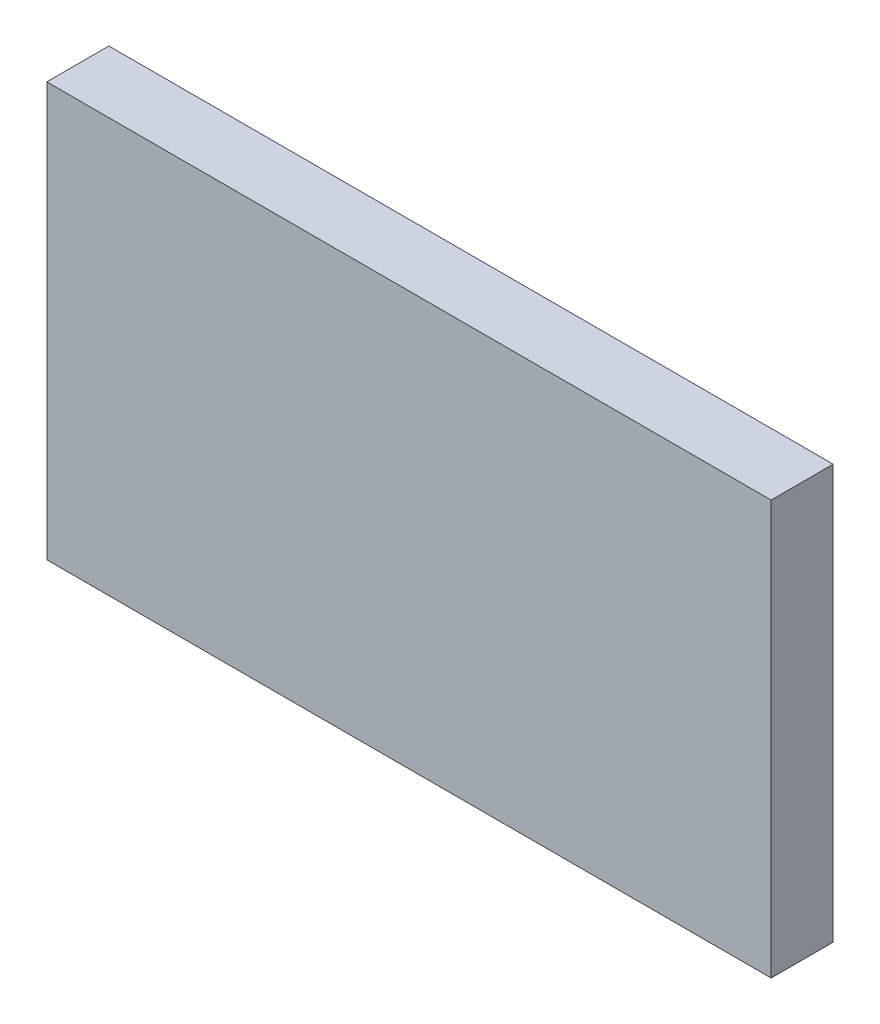
ISO-10303-21;
HEADER;
FILE_DESCRIPTION(('STEP AP214'),'2;1');
FILE_NAME('part.step','',(''),(''),'','','');
FILE_SCHEMA(('AUTOMOTIVE_DESIGN { 1 0 10303 214 1 1 1 1 }'));
ENDSEC;
DATA;
#1=APPLICATION_CONTEXT('core data for automotive mechanical design processes');
#2=APPLICATION_PROTOCOL_DEFINITION('international standard','automotive_design',2000,#1);
#3=PRODUCT_CONTEXT('',#1,'mechanical');
#4=PRODUCT('Part','Part','',(#3));
#5=PRODUCT_RELATED_PRODUCT_CATEGORY('part','',(#4));
#6=PRODUCT_DEFINITION_FORMATION('','',#4);
#7=PRODUCT_DEFINITION_CONTEXT('part definition',#1,'design');
#8=PRODUCT_DEFINITION('design','',#6,#7);
#9=PRODUCT_DEFINITION_SHAPE('','',#8);
#10=(LENGTH_UNIT() NAMED_UNIT(*) SI_UNIT(.MILLI.,.METRE.));
#11=(NAMED_UNIT(*) PLANE_ANGLE_UNIT() SI_UNIT($,.RADIAN.));
#12=(NAMED_UNIT(*) SI_UNIT($,.STERADIAN.) SOLID_ANGLE_UNIT());
#13=UNCERTAINTY_MEASURE_WITH_UNIT(LENGTH_MEASURE(1.E-05),#10,'distance_accuracy_value','');
#14=(GEOMETRIC_REPRESENTATION_CONTEXT(3) GLOBAL_UNCERTAINTY_ASSIGNED_CONTEXT((#13)) GLOBAL_UNIT_ASSIGNED_CONTEXT((#10,
#11,#12)) REPRESENTATION_CONTEXT('',''));
#15=CARTESIAN_POINT('',(0.,0.,0.));
#16=DIRECTION('',(0.,0.,1.));
#17=DIRECTION('',(1.,0.,0.));
#18=AXIS2_PLACEMENT_3D('',#15,#16,#17);
#19=CARTESIAN_POINT('',(-17.9136054421769,11.14,3.));
#20=DIRECTION('',(1.,0.,0.));
#21=DIRECTION('',(0.,0.,-1.));
#22=AXIS2_PLACEMENT_3D('',#19,#20,#21);
#23=PLANE('',#22);
#24=DIRECTION('',(0.,-1.,0.));
#25=VECTOR('',#24,1.);
#26=CARTESIAN_POINT('',(-17.9136054421769,11.14,0.));
#27=LINE('',#26,#25);
#28=CARTESIAN_POINT('',(-17.9136054421769,11.14,0.));
#29=VERTEX_POINT('',#28);
#30=CARTESIAN_POINT('',(-17.9136054421769,-8.86,0.));
#31=VERTEX_POINT('',#30);
#32=EDGE_CURVE('E95',#29,#31,#27,.T.);
#33=ORIENTED_EDGE('',*,*,#32,.T.);
#34=DIRECTION('',(0.,0.,-1.));
#35=VECTOR('',#34,1.);
#36=CARTESIAN_POINT('',(-17.9136054421769,-8.86,3.));
#37=LINE('',#36,#35);
#38=CARTESIAN_POINT('',(-17.9136054421769,-8.86,3.));
#39=VERTEX_POINT('',#38);
#40=EDGE_CURVE('E11',#39,#31,#37,.T.);
#41=ORIENTED_EDGE('',*,*,#40,.F.);
#42=DIRECTION('',(0.,-1.,0.));
#43=VECTOR('',#42,1.);
#44=CARTESIAN_POINT('',(-17.9136054421769,11.14,3.));
#45=LINE('',#44,#43);
#46=CARTESIAN_POINT('',(-17.9136054421769,11.14,3.));
#47=VERTEX_POINT('',#46);
#48=EDGE_CURVE('E83',#47,#39,#45,.T.);
#49=ORIENTED_EDGE('',*,*,#48,.F.);
#50=DIRECTION('',(0.,0.,-1.));
#51=VECTOR('',#50,1.);
#52=CARTESIAN_POINT('',(-17.9136054421769,11.14,3.));
#53=LINE('',#52,#51);
#54=EDGE_CURVE('E91',#47,#29,#53,.T.);
#55=ORIENTED_EDGE('',*,*,#54,.T.);
#56=EDGE_LOOP('',(#33,#41,#49,#55));
#57=FACE_BOUND('',#56,.T.);
#58=ADVANCED_FACE('F32',(#57),#23,.F.);
#59=CARTESIAN_POINT('',(-17.9136054421769,-8.86,3.));
#60=DIRECTION('',(0.,1.,0.));
#61=DIRECTION('',(0.,0.,1.));
#62=AXIS2_PLACEMENT_3D('',#59,#60,#61);
#63=PLANE('',#62);
#64=DIRECTION('',(1.,0.,0.));
#65=VECTOR('',#64,1.);
#66=CARTESIAN_POINT('',(-17.9136054421769,-8.86,0.));
#67=LINE('',#66,#65);
#68=CARTESIAN_POINT('',(17.0863945578231,-8.86,0.));
#69=VERTEX_POINT('',#68);
#70=EDGE_CURVE('E87',#31,#69,#67,.T.);
#71=ORIENTED_EDGE('',*,*,#70,.T.);
#72=DIRECTION('',(0.,0.,-1.));
#73=VECTOR('',#72,1.);
#74=CARTESIAN_POINT('',(17.0863945578231,-8.86,3.));
#75=LINE('',#74,#73);
#76=CARTESIAN_POINT('',(17.0863945578231,-8.86,3.));
#77=VERTEX_POINT('',#76);
#78=EDGE_CURVE('E40',#77,#69,#75,.T.);
#79=ORIENTED_EDGE('',*,*,#78,.F.);
#80=DIRECTION('',(1.,0.,0.));
#81=VECTOR('',#80,1.);
#82=CARTESIAN_POINT('',(-17.9136054421769,-8.86,3.));
#83=LINE('',#82,#81);
#84=EDGE_CURVE('E78',#39,#77,#83,.T.);
#85=ORIENTED_EDGE('',*,*,#84,.F.);
#86=ORIENTED_EDGE('',*,*,#40,.T.);
#87=EDGE_LOOP('',(#71,#79,#85,#86));
#88=FACE_BOUND('',#87,.T.);
#89=ADVANCED_FACE('F86',(#88),#63,.F.);
#90=CARTESIAN_POINT('',(17.0863945578231,11.14,3.));
#91=DIRECTION('',(-1.,0.,0.));
#92=DIRECTION('',(0.,0.,1.));
#93=AXIS2_PLACEMENT_3D('',#90,#91,#92);
#94=PLANE('',#93);
#95=DIRECTION('',(0.,1.,0.));
#96=VECTOR('',#95,1.);
#97=CARTESIAN_POINT('',(17.0863945578231,11.14,0.));
#98=LINE('',#97,#96);
#99=CARTESIAN_POINT('',(17.0863945578231,11.14,0.));
#100=VERTEX_POINT('',#99);
#101=EDGE_CURVE('E65',#69,#100,#98,.T.);
#102=ORIENTED_EDGE('',*,*,#101,.T.);
#103=DIRECTION('',(0.,0.,-1.));
#104=VECTOR('',#103,1.);
#105=CARTESIAN_POINT('',(17.0863945578231,11.14,3.));
#106=LINE('',#105,#104);
#107=CARTESIAN_POINT('',(17.0863945578231,11.14,3.));
#108=VERTEX_POINT('',#107);
#109=EDGE_CURVE('E88',#108,#100,#106,.T.);
#110=ORIENTED_EDGE('',*,*,#109,.F.);
#111=DIRECTION('',(0.,1.,0.));
#112=VECTOR('',#111,1.);
#113=CARTESIAN_POINT('',(17.0863945578231,11.14,3.));
#114=LINE('',#113,#112);
#115=EDGE_CURVE('E81',#77,#108,#114,.T.);
#116=ORIENTED_EDGE('',*,*,#115,.F.);
#117=ORIENTED_EDGE('',*,*,#78,.T.);
#118=EDGE_LOOP('',(#102,#110,#116,#117));
#119=FACE_BOUND('',#118,.T.);
#120=ADVANCED_FACE('F89',(#119),#94,.F.);
#121=CARTESIAN_POINT('',(-17.9136054421769,11.14,3.));
#122=DIRECTION('',(0.,-1.,0.));
#123=DIRECTION('',(0.,0.,-1.));
#124=AXIS2_PLACEMENT_3D('',#121,#122,#123);
#125=PLANE('',#124);
#126=DIRECTION('',(-1.,0.,0.));
#127=VECTOR('',#126,1.);
#128=CARTESIAN_POINT('',(-17.9136054421769,11.14,0.));
#129=LINE('',#128,#127);
#130=EDGE_CURVE('E71',#100,#29,#129,.T.);
#131=ORIENTED_EDGE('',*,*,#130,.T.);
#132=ORIENTED_EDGE('',*,*,#54,.F.);
#133=DIRECTION('',(-1.,0.,0.));
#134=VECTOR('',#133,1.);
#135=CARTESIAN_POINT('',(-17.9136054421769,11.14,3.));
#136=LINE('',#135,#134);
#137=EDGE_CURVE('E48',#108,#47,#136,.T.);
#138=ORIENTED_EDGE('',*,*,#137,.F.);
#139=ORIENTED_EDGE('',*,*,#109,.T.);
#140=EDGE_LOOP('',(#131,#132,#138,#139));
#141=FACE_BOUND('',#140,.T.);
#142=ADVANCED_FACE('F102',(#141),#125,.F.);
#143=CARTESIAN_POINT('',(0.,0.,3.));
#144=DIRECTION('',(0.,0.,1.));
#145=DIRECTION('',(1.,0.,0.));
#146=AXIS2_PLACEMENT_3D('',#143,#144,#145);
#147=PLANE('',#146);
#148=ORIENTED_EDGE('',*,*,#48,.T.);
#149=ORIENTED_EDGE('',*,*,#84,.T.);
#150=ORIENTED_EDGE('',*,*,#115,.T.);
#151=ORIENTED_EDGE('',*,*,#137,.T.);
#152=EDGE_LOOP('',(#148,#149,#150,#151));
#153=FACE_BOUND('',#152,.T.);
#154=ADVANCED_FACE('F79',(#153),#147,.T.);
#155=CARTESIAN_POINT('',(0.,0.,0.));
#156=DIRECTION('',(0.,0.,1.));
#157=DIRECTION('',(1.,0.,0.));
#158=AXIS2_PLACEMENT_3D('',#155,#156,#157);
#159=PLANE('',#158);
#160=ORIENTED_EDGE('',*,*,#32,.F.);
#161=ORIENTED_EDGE('',*,*,#130,.F.);
#162=ORIENTED_EDGE('',*,*,#101,.F.);
#163=ORIENTED_EDGE('',*,*,#70,.F.);
#164=EDGE_LOOP('',(#160,#161,#162,#163));
#165=FACE_BOUND('',#164,.T.);
#166=ADVANCED_FACE('F105',(#165),#159,.F.);
#167=CLOSED_SHELL('',(#58,#89,#120,#142,#154,#166));
#168=MANIFOLD_SOLID_BREP('B2',#167);
#169=ADVANCED_BREP_SHAPE_REPRESENTATION('',(#18,#168),#14);
#170=SHAPE_DEFINITION_REPRESENTATION(#9,#169);
ENDSEC;
END-ISO-10303-21;
